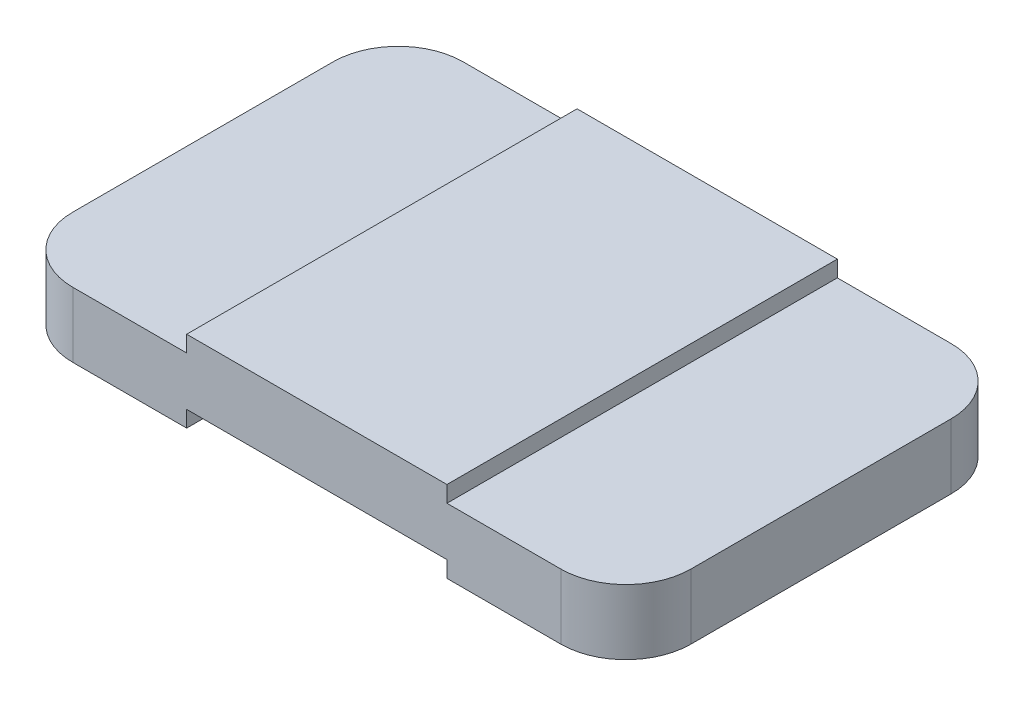
ISO-10303-21;
HEADER;
FILE_DESCRIPTION(('STEP AP214'),'2;1');
FILE_NAME('part.step','',(''),(''),'','','');
FILE_SCHEMA(('AUTOMOTIVE_DESIGN { 1 0 10303 214 1 1 1 1 }'));
ENDSEC;
DATA;
#1=APPLICATION_CONTEXT('core data for automotive mechanical design processes');
#2=APPLICATION_PROTOCOL_DEFINITION('international standard','automotive_design',2000,#1);
#3=PRODUCT_CONTEXT('',#1,'mechanical');
#4=PRODUCT('Part','Part','',(#3));
#5=PRODUCT_RELATED_PRODUCT_CATEGORY('part','',(#4));
#6=PRODUCT_DEFINITION_FORMATION('','',#4);
#7=PRODUCT_DEFINITION_CONTEXT('part definition',#1,'design');
#8=PRODUCT_DEFINITION('design','',#6,#7);
#9=PRODUCT_DEFINITION_SHAPE('','',#8);
#10=(LENGTH_UNIT() NAMED_UNIT(*) SI_UNIT(.MILLI.,.METRE.));
#11=(NAMED_UNIT(*) PLANE_ANGLE_UNIT() SI_UNIT($,.RADIAN.));
#12=(NAMED_UNIT(*) SI_UNIT($,.STERADIAN.) SOLID_ANGLE_UNIT());
#13=UNCERTAINTY_MEASURE_WITH_UNIT(LENGTH_MEASURE(1.E-05),#10,'distance_accuracy_value','');
#14=(GEOMETRIC_REPRESENTATION_CONTEXT(3) GLOBAL_UNCERTAINTY_ASSIGNED_CONTEXT((#13)) GLOBAL_UNIT_ASSIGNED_CONTEXT((#10,
#11,#12)) REPRESENTATION_CONTEXT('',''));
#15=CARTESIAN_POINT('',(0.,0.,0.));
#16=DIRECTION('',(0.,0.,1.));
#17=DIRECTION('',(1.,0.,0.));
#18=AXIS2_PLACEMENT_3D('',#15,#16,#17);
#19=CARTESIAN_POINT('',(0.,0.5,-3.));
#20=DIRECTION('',(-1.,0.,0.));
#21=DIRECTION('',(0.,-1.,0.));
#22=AXIS2_PLACEMENT_3D('',#19,#20,#21);
#23=PLANE('',#22);
#24=DIRECTION('',(0.,0.,1.));
#25=VECTOR('',#24,1.);
#26=CARTESIAN_POINT('',(0.,0.5,-3.));
#27=LINE('',#26,#25);
#28=CARTESIAN_POINT('',(0.,0.5,-2.5));
#29=VERTEX_POINT('',#28);
#30=CARTESIAN_POINT('',(0.,0.5,-0.5));
#31=VERTEX_POINT('',#30);
#32=EDGE_CURVE('E218',#29,#31,#27,.T.);
#33=ORIENTED_EDGE('',*,*,#32,.F.);
#34=DIRECTION('',(0.,-1.,0.));
#35=VECTOR('',#34,1.);
#36=CARTESIAN_POINT('',(0.,0.,-2.5));
#37=LINE('',#36,#35);
#38=CARTESIAN_POINT('',(0.,0.,-2.5));
#39=VERTEX_POINT('',#38);
#40=EDGE_CURVE('E267',#29,#39,#37,.T.);
#41=ORIENTED_EDGE('',*,*,#40,.T.);
#42=DIRECTION('',(0.,0.,1.));
#43=VECTOR('',#42,1.);
#44=CARTESIAN_POINT('',(0.,0.,-3.));
#45=LINE('',#44,#43);
#46=CARTESIAN_POINT('',(0.,0.,-0.5));
#47=VERTEX_POINT('',#46);
#48=EDGE_CURVE('E162',#39,#47,#45,.T.);
#49=ORIENTED_EDGE('',*,*,#48,.T.);
#50=DIRECTION('',(0.,-1.,0.));
#51=VECTOR('',#50,1.);
#52=CARTESIAN_POINT('',(0.,0.5,-0.5));
#53=LINE('',#52,#51);
#54=EDGE_CURVE('E265',#47,#31,#53,.F.);
#55=ORIENTED_EDGE('',*,*,#54,.T.);
#56=EDGE_LOOP('',(#33,#41,#49,#55));
#57=FACE_BOUND('',#56,.T.);
#58=ADVANCED_FACE('F33',(#57),#23,.T.);
#59=CARTESIAN_POINT('',(1.375,0.5,-3.));
#60=DIRECTION('',(0.,1.,0.));
#61=DIRECTION('',(-1.,0.,0.));
#62=AXIS2_PLACEMENT_3D('',#59,#60,#61);
#63=PLANE('',#62);
#64=DIRECTION('',(-1.,0.,0.));
#65=VECTOR('',#64,1.);
#66=CARTESIAN_POINT('',(1.375,0.5,-3.));
#67=LINE('',#66,#65);
#68=CARTESIAN_POINT('',(1.375,0.5,-3.));
#69=VERTEX_POINT('',#68);
#70=CARTESIAN_POINT('',(0.5,0.5,-3.));
#71=VERTEX_POINT('',#70);
#72=EDGE_CURVE('E190',#69,#71,#67,.T.);
#73=ORIENTED_EDGE('',*,*,#72,.T.);
#74=CARTESIAN_POINT('',(0.5,0.5,-2.5));
#75=DIRECTION('',(0.,1.,0.));
#76=DIRECTION('',(-1.,0.,0.));
#77=AXIS2_PLACEMENT_3D('',#74,#75,#76);
#78=CIRCLE('',#77,0.5);
#79=EDGE_CURVE('E11',#71,#29,#78,.T.);
#80=ORIENTED_EDGE('',*,*,#79,.T.);
#81=ORIENTED_EDGE('',*,*,#32,.T.);
#82=CARTESIAN_POINT('',(0.5,0.5,-0.5));
#83=DIRECTION('',(0.,1.,0.));
#84=DIRECTION('',(-1.,0.,0.));
#85=AXIS2_PLACEMENT_3D('',#82,#83,#84);
#86=CIRCLE('',#85,0.5);
#87=CARTESIAN_POINT('',(0.5,0.5,0.));
#88=VERTEX_POINT('',#87);
#89=EDGE_CURVE('E41',#31,#88,#86,.T.);
#90=ORIENTED_EDGE('',*,*,#89,.T.);
#91=DIRECTION('',(-1.,0.,0.));
#92=VECTOR('',#91,1.);
#93=CARTESIAN_POINT('',(1.375,0.5,0.));
#94=LINE('',#93,#92);
#95=CARTESIAN_POINT('',(1.375,0.5,0.));
#96=VERTEX_POINT('',#95);
#97=EDGE_CURVE('E154',#96,#88,#94,.T.);
#98=ORIENTED_EDGE('',*,*,#97,.F.);
#99=DIRECTION('',(0.,0.,1.));
#100=VECTOR('',#99,1.);
#101=CARTESIAN_POINT('',(1.375,0.5,-3.));
#102=LINE('',#101,#100);
#103=EDGE_CURVE('E222',#69,#96,#102,.T.);
#104=ORIENTED_EDGE('',*,*,#103,.F.);
#105=EDGE_LOOP('',(#73,#80,#81,#90,#98,#104));
#106=FACE_BOUND('',#105,.T.);
#107=ADVANCED_FACE('F273',(#106),#63,.T.);
#108=CARTESIAN_POINT('',(1.375,0.625,-3.));
#109=DIRECTION('',(-1.,0.,0.));
#110=DIRECTION('',(0.,0.,1.));
#111=AXIS2_PLACEMENT_3D('',#108,#109,#110);
#112=PLANE('',#111);
#113=DIRECTION('',(0.,-1.,0.));
#114=VECTOR('',#113,1.);
#115=CARTESIAN_POINT('',(1.375,0.625,0.));
#116=LINE('',#115,#114);
#117=CARTESIAN_POINT('',(1.375,0.625,0.));
#118=VERTEX_POINT('',#117);
#119=EDGE_CURVE('E213',#118,#96,#116,.T.);
#120=ORIENTED_EDGE('',*,*,#119,.F.);
#121=DIRECTION('',(0.,0.,1.));
#122=VECTOR('',#121,1.);
#123=CARTESIAN_POINT('',(1.375,0.625,-3.));
#124=LINE('',#123,#122);
#125=CARTESIAN_POINT('',(1.375,0.625,-3.));
#126=VERTEX_POINT('',#125);
#127=EDGE_CURVE('E224',#126,#118,#124,.T.);
#128=ORIENTED_EDGE('',*,*,#127,.F.);
#129=DIRECTION('',(0.,-1.,0.));
#130=VECTOR('',#129,1.);
#131=CARTESIAN_POINT('',(1.375,0.625,-3.));
#132=LINE('',#131,#130);
#133=EDGE_CURVE('E187',#126,#69,#132,.T.);
#134=ORIENTED_EDGE('',*,*,#133,.T.);
#135=ORIENTED_EDGE('',*,*,#103,.T.);
#136=EDGE_LOOP('',(#120,#128,#134,#135));
#137=FACE_BOUND('',#136,.T.);
#138=ADVANCED_FACE('F335',(#137),#112,.T.);
#139=CARTESIAN_POINT('',(3.375,0.625,-3.));
#140=DIRECTION('',(0.,1.,0.));
#141=DIRECTION('',(-1.,0.,0.));
#142=AXIS2_PLACEMENT_3D('',#139,#140,#141);
#143=PLANE('',#142);
#144=DIRECTION('',(-1.,0.,0.));
#145=VECTOR('',#144,1.);
#146=CARTESIAN_POINT('',(3.375,0.625,0.));
#147=LINE('',#146,#145);
#148=CARTESIAN_POINT('',(3.375,0.625,0.));
#149=VERTEX_POINT('',#148);
#150=EDGE_CURVE('E210',#149,#118,#147,.T.);
#151=ORIENTED_EDGE('',*,*,#150,.F.);
#152=DIRECTION('',(0.,0.,1.));
#153=VECTOR('',#152,1.);
#154=CARTESIAN_POINT('',(3.375,0.625,-3.));
#155=LINE('',#154,#153);
#156=CARTESIAN_POINT('',(3.375,0.625,-3.));
#157=VERTEX_POINT('',#156);
#158=EDGE_CURVE('E226',#157,#149,#155,.T.);
#159=ORIENTED_EDGE('',*,*,#158,.F.);
#160=DIRECTION('',(-1.,0.,0.));
#161=VECTOR('',#160,1.);
#162=CARTESIAN_POINT('',(3.375,0.625,-3.));
#163=LINE('',#162,#161);
#164=EDGE_CURVE('E184',#157,#126,#163,.T.);
#165=ORIENTED_EDGE('',*,*,#164,.T.);
#166=ORIENTED_EDGE('',*,*,#127,.T.);
#167=EDGE_LOOP('',(#151,#159,#165,#166));
#168=FACE_BOUND('',#167,.T.);
#169=ADVANCED_FACE('F291',(#168),#143,.T.);
#170=CARTESIAN_POINT('',(3.375,0.5,-3.));
#171=DIRECTION('',(1.,0.,0.));
#172=DIRECTION('',(0.,1.,0.));
#173=AXIS2_PLACEMENT_3D('',#170,#171,#172);
#174=PLANE('',#173);
#175=DIRECTION('',(0.,1.,0.));
#176=VECTOR('',#175,1.);
#177=CARTESIAN_POINT('',(3.375,0.5,0.));
#178=LINE('',#177,#176);
#179=CARTESIAN_POINT('',(3.375,0.5,0.));
#180=VERTEX_POINT('',#179);
#181=EDGE_CURVE('E207',#180,#149,#178,.T.);
#182=ORIENTED_EDGE('',*,*,#181,.F.);
#183=DIRECTION('',(0.,0.,1.));
#184=VECTOR('',#183,1.);
#185=CARTESIAN_POINT('',(3.375,0.5,-3.));
#186=LINE('',#185,#184);
#187=CARTESIAN_POINT('',(3.375,0.5,-3.));
#188=VERTEX_POINT('',#187);
#189=EDGE_CURVE('E228',#188,#180,#186,.T.);
#190=ORIENTED_EDGE('',*,*,#189,.F.);
#191=DIRECTION('',(0.,1.,0.));
#192=VECTOR('',#191,1.);
#193=CARTESIAN_POINT('',(3.375,0.5,-3.));
#194=LINE('',#193,#192);
#195=EDGE_CURVE('E181',#188,#157,#194,.T.);
#196=ORIENTED_EDGE('',*,*,#195,.T.);
#197=ORIENTED_EDGE('',*,*,#158,.T.);
#198=EDGE_LOOP('',(#182,#190,#196,#197));
#199=FACE_BOUND('',#198,.T.);
#200=ADVANCED_FACE('F294',(#199),#174,.T.);
#201=CARTESIAN_POINT('',(4.75,0.5,-3.));
#202=DIRECTION('',(0.,1.,0.));
#203=DIRECTION('',(-1.,0.,0.));
#204=AXIS2_PLACEMENT_3D('',#201,#202,#203);
#205=PLANE('',#204);
#206=DIRECTION('',(0.,0.,1.));
#207=VECTOR('',#206,1.);
#208=CARTESIAN_POINT('',(4.75,0.5,-3.));
#209=LINE('',#208,#207);
#210=CARTESIAN_POINT('',(4.75,0.5,-2.5));
#211=VERTEX_POINT('',#210);
#212=CARTESIAN_POINT('',(4.75,0.5,-0.5));
#213=VERTEX_POINT('',#212);
#214=EDGE_CURVE('E231',#211,#213,#209,.T.);
#215=ORIENTED_EDGE('',*,*,#214,.F.);
#216=CARTESIAN_POINT('',(4.25,0.5,-2.5));
#217=DIRECTION('',(0.,1.,0.));
#218=DIRECTION('',(-1.,0.,0.));
#219=AXIS2_PLACEMENT_3D('',#216,#217,#218);
#220=CIRCLE('',#219,0.5);
#221=CARTESIAN_POINT('',(4.25,0.5,-3.));
#222=VERTEX_POINT('',#221);
#223=EDGE_CURVE('E249',#211,#222,#220,.T.);
#224=ORIENTED_EDGE('',*,*,#223,.T.);
#225=DIRECTION('',(-1.,0.,0.));
#226=VECTOR('',#225,1.);
#227=CARTESIAN_POINT('',(4.75,0.5,-3.));
#228=LINE('',#227,#226);
#229=EDGE_CURVE('E179',#222,#188,#228,.T.);
#230=ORIENTED_EDGE('',*,*,#229,.T.);
#231=ORIENTED_EDGE('',*,*,#189,.T.);
#232=DIRECTION('',(-1.,0.,0.));
#233=VECTOR('',#232,1.);
#234=CARTESIAN_POINT('',(4.75,0.5,0.));
#235=LINE('',#234,#233);
#236=CARTESIAN_POINT('',(4.25,0.5,0.));
#237=VERTEX_POINT('',#236);
#238=EDGE_CURVE('E205',#237,#180,#235,.T.);
#239=ORIENTED_EDGE('',*,*,#238,.F.);
#240=CARTESIAN_POINT('',(4.25,0.5,-0.5));
#241=DIRECTION('',(0.,1.,0.));
#242=DIRECTION('',(-1.,0.,0.));
#243=AXIS2_PLACEMENT_3D('',#240,#241,#242);
#244=CIRCLE('',#243,0.5);
#245=EDGE_CURVE('E247',#237,#213,#244,.T.);
#246=ORIENTED_EDGE('',*,*,#245,.T.);
#247=EDGE_LOOP('',(#215,#224,#230,#231,#239,#246));
#248=FACE_BOUND('',#247,.T.);
#249=ADVANCED_FACE('F406',(#248),#205,.T.);
#250=CARTESIAN_POINT('',(4.75,0.,-3.));
#251=DIRECTION('',(1.,0.,0.));
#252=DIRECTION('',(0.,0.,-1.));
#253=AXIS2_PLACEMENT_3D('',#250,#251,#252);
#254=PLANE('',#253);
#255=DIRECTION('',(0.,0.,1.));
#256=VECTOR('',#255,1.);
#257=CARTESIAN_POINT('',(4.75,0.,-3.));
#258=LINE('',#257,#256);
#259=CARTESIAN_POINT('',(4.75,0.,-2.5));
#260=VERTEX_POINT('',#259);
#261=CARTESIAN_POINT('',(4.75,0.,-0.5));
#262=VERTEX_POINT('',#261);
#263=EDGE_CURVE('E234',#260,#262,#258,.T.);
#264=ORIENTED_EDGE('',*,*,#263,.F.);
#265=DIRECTION('',(0.,1.,0.));
#266=VECTOR('',#265,1.);
#267=CARTESIAN_POINT('',(4.75,0.5,-2.5));
#268=LINE('',#267,#266);
#269=EDGE_CURVE('E244',#260,#211,#268,.T.);
#270=ORIENTED_EDGE('',*,*,#269,.T.);
#271=ORIENTED_EDGE('',*,*,#214,.T.);
#272=DIRECTION('',(0.,1.,0.));
#273=VECTOR('',#272,1.);
#274=CARTESIAN_POINT('',(4.75,0.,-0.5));
#275=LINE('',#274,#273);
#276=EDGE_CURVE('E221',#213,#262,#275,.F.);
#277=ORIENTED_EDGE('',*,*,#276,.T.);
#278=EDGE_LOOP('',(#264,#270,#271,#277));
#279=FACE_BOUND('',#278,.T.);
#280=ADVANCED_FACE('F308',(#279),#254,.T.);
#281=CARTESIAN_POINT('',(3.375,0.,-3.));
#282=DIRECTION('',(0.,-1.,0.));
#283=DIRECTION('',(1.,0.,0.));
#284=AXIS2_PLACEMENT_3D('',#281,#282,#283);
#285=PLANE('',#284);
#286=DIRECTION('',(1.,0.,0.));
#287=VECTOR('',#286,1.);
#288=CARTESIAN_POINT('',(3.375,0.,-3.));
#289=LINE('',#288,#287);
#290=CARTESIAN_POINT('',(3.375,0.,-3.));
#291=VERTEX_POINT('',#290);
#292=CARTESIAN_POINT('',(4.25,0.,-3.));
#293=VERTEX_POINT('',#292);
#294=EDGE_CURVE('E176',#291,#293,#289,.T.);
#295=ORIENTED_EDGE('',*,*,#294,.T.);
#296=CARTESIAN_POINT('',(4.25,0.,-2.5));
#297=DIRECTION('',(0.,-1.,0.));
#298=DIRECTION('',(1.,0.,0.));
#299=AXIS2_PLACEMENT_3D('',#296,#297,#298);
#300=CIRCLE('',#299,0.5);
#301=EDGE_CURVE('E257',#293,#260,#300,.T.);
#302=ORIENTED_EDGE('',*,*,#301,.T.);
#303=ORIENTED_EDGE('',*,*,#263,.T.);
#304=CARTESIAN_POINT('',(4.25,0.,-0.5));
#305=DIRECTION('',(0.,-1.,0.));
#306=DIRECTION('',(1.,0.,0.));
#307=AXIS2_PLACEMENT_3D('',#304,#305,#306);
#308=CIRCLE('',#307,0.5);
#309=CARTESIAN_POINT('',(4.25,0.,0.));
#310=VERTEX_POINT('',#309);
#311=EDGE_CURVE('E255',#262,#310,#308,.T.);
#312=ORIENTED_EDGE('',*,*,#311,.T.);
#313=DIRECTION('',(1.,0.,0.));
#314=VECTOR('',#313,1.);
#315=CARTESIAN_POINT('',(3.375,0.,0.));
#316=LINE('',#315,#314);
#317=CARTESIAN_POINT('',(3.375,0.,0.));
#318=VERTEX_POINT('',#317);
#319=EDGE_CURVE('E202',#318,#310,#316,.T.);
#320=ORIENTED_EDGE('',*,*,#319,.F.);
#321=DIRECTION('',(0.,0.,1.));
#322=VECTOR('',#321,1.);
#323=CARTESIAN_POINT('',(3.375,0.,-3.));
#324=LINE('',#323,#322);
#325=EDGE_CURVE('E237',#291,#318,#324,.T.);
#326=ORIENTED_EDGE('',*,*,#325,.F.);
#327=EDGE_LOOP('',(#295,#302,#303,#312,#320,#326));
#328=FACE_BOUND('',#327,.T.);
#329=ADVANCED_FACE('F305',(#328),#285,.T.);
#330=CARTESIAN_POINT('',(3.375,0.125,-3.));
#331=DIRECTION('',(-1.,0.,0.));
#332=DIRECTION('',(0.,0.,1.));
#333=AXIS2_PLACEMENT_3D('',#330,#331,#332);
#334=PLANE('',#333);
#335=DIRECTION('',(0.,-1.,0.));
#336=VECTOR('',#335,1.);
#337=CARTESIAN_POINT('',(3.375,0.125,0.));
#338=LINE('',#337,#336);
#339=CARTESIAN_POINT('',(3.375,0.125,0.));
#340=VERTEX_POINT('',#339);
#341=EDGE_CURVE('E199',#340,#318,#338,.T.);
#342=ORIENTED_EDGE('',*,*,#341,.F.);
#343=DIRECTION('',(0.,0.,1.));
#344=VECTOR('',#343,1.);
#345=CARTESIAN_POINT('',(3.375,0.125,-3.));
#346=LINE('',#345,#344);
#347=CARTESIAN_POINT('',(3.375,0.125,-3.));
#348=VERTEX_POINT('',#347);
#349=EDGE_CURVE('E239',#348,#340,#346,.T.);
#350=ORIENTED_EDGE('',*,*,#349,.F.);
#351=DIRECTION('',(0.,-1.,0.));
#352=VECTOR('',#351,1.);
#353=CARTESIAN_POINT('',(3.375,0.125,-3.));
#354=LINE('',#353,#352);
#355=EDGE_CURVE('E171',#348,#291,#354,.T.);
#356=ORIENTED_EDGE('',*,*,#355,.T.);
#357=ORIENTED_EDGE('',*,*,#325,.T.);
#358=EDGE_LOOP('',(#342,#350,#356,#357));
#359=FACE_BOUND('',#358,.T.);
#360=ADVANCED_FACE('F319',(#359),#334,.T.);
#361=CARTESIAN_POINT('',(1.375,0.125,-3.));
#362=DIRECTION('',(0.,-1.,0.));
#363=DIRECTION('',(0.,0.,-1.));
#364=AXIS2_PLACEMENT_3D('',#361,#362,#363);
#365=PLANE('',#364);
#366=DIRECTION('',(1.,0.,0.));
#367=VECTOR('',#366,1.);
#368=CARTESIAN_POINT('',(1.375,0.125,0.));
#369=LINE('',#368,#367);
#370=CARTESIAN_POINT('',(1.375,0.125,0.));
#371=VERTEX_POINT('',#370);
#372=EDGE_CURVE('E196',#371,#340,#369,.T.);
#373=ORIENTED_EDGE('',*,*,#372,.F.);
#374=DIRECTION('',(0.,0.,1.));
#375=VECTOR('',#374,1.);
#376=CARTESIAN_POINT('',(1.375,0.125,-3.));
#377=LINE('',#376,#375);
#378=CARTESIAN_POINT('',(1.375,0.125,-3.));
#379=VERTEX_POINT('',#378);
#380=EDGE_CURVE('E161',#379,#371,#377,.T.);
#381=ORIENTED_EDGE('',*,*,#380,.F.);
#382=DIRECTION('',(1.,0.,0.));
#383=VECTOR('',#382,1.);
#384=CARTESIAN_POINT('',(1.375,0.125,-3.));
#385=LINE('',#384,#383);
#386=EDGE_CURVE('E169',#379,#348,#385,.T.);
#387=ORIENTED_EDGE('',*,*,#386,.T.);
#388=ORIENTED_EDGE('',*,*,#349,.T.);
#389=EDGE_LOOP('',(#373,#381,#387,#388));
#390=FACE_BOUND('',#389,.T.);
#391=ADVANCED_FACE('F321',(#390),#365,.T.);
#392=CARTESIAN_POINT('',(1.375,0.,-3.));
#393=DIRECTION('',(1.,0.,0.));
#394=DIRECTION('',(0.,0.,-1.));
#395=AXIS2_PLACEMENT_3D('',#392,#393,#394);
#396=PLANE('',#395);
#397=DIRECTION('',(0.,1.,0.));
#398=VECTOR('',#397,1.);
#399=CARTESIAN_POINT('',(1.375,0.,0.));
#400=LINE('',#399,#398);
#401=CARTESIAN_POINT('',(1.375,0.,0.));
#402=VERTEX_POINT('',#401);
#403=EDGE_CURVE('E160',#402,#371,#400,.T.);
#404=ORIENTED_EDGE('',*,*,#403,.F.);
#405=DIRECTION('',(0.,0.,1.));
#406=VECTOR('',#405,1.);
#407=CARTESIAN_POINT('',(1.375,0.,-3.));
#408=LINE('',#407,#406);
#409=CARTESIAN_POINT('',(1.375,0.,-3.));
#410=VERTEX_POINT('',#409);
#411=EDGE_CURVE('E149',#410,#402,#408,.T.);
#412=ORIENTED_EDGE('',*,*,#411,.F.);
#413=DIRECTION('',(0.,1.,0.));
#414=VECTOR('',#413,1.);
#415=CARTESIAN_POINT('',(1.375,0.,-3.));
#416=LINE('',#415,#414);
#417=EDGE_CURVE('E153',#410,#379,#416,.T.);
#418=ORIENTED_EDGE('',*,*,#417,.T.);
#419=ORIENTED_EDGE('',*,*,#380,.T.);
#420=EDGE_LOOP('',(#404,#412,#418,#419));
#421=FACE_BOUND('',#420,.T.);
#422=ADVANCED_FACE('F158',(#421),#396,.T.);
#423=CARTESIAN_POINT('',(0.,0.,-3.));
#424=DIRECTION('',(0.,-1.,0.));
#425=DIRECTION('',(0.,0.,-1.));
#426=AXIS2_PLACEMENT_3D('',#423,#424,#425);
#427=PLANE('',#426);
#428=ORIENTED_EDGE('',*,*,#48,.F.);
#429=CARTESIAN_POINT('',(0.5,0.,-2.5));
#430=DIRECTION('',(0.,-1.,0.));
#431=DIRECTION('',(0.,0.,-1.));
#432=AXIS2_PLACEMENT_3D('',#429,#430,#431);
#433=CIRCLE('',#432,0.5);
#434=CARTESIAN_POINT('',(0.5,0.,-3.));
#435=VERTEX_POINT('',#434);
#436=EDGE_CURVE('E56',#39,#435,#433,.T.);
#437=ORIENTED_EDGE('',*,*,#436,.T.);
#438=DIRECTION('',(1.,0.,0.));
#439=VECTOR('',#438,1.);
#440=CARTESIAN_POINT('',(0.,0.,-3.));
#441=LINE('',#440,#439);
#442=EDGE_CURVE('E146',#435,#410,#441,.T.);
#443=ORIENTED_EDGE('',*,*,#442,.T.);
#444=ORIENTED_EDGE('',*,*,#411,.T.);
#445=DIRECTION('',(1.,0.,0.));
#446=VECTOR('',#445,1.);
#447=CARTESIAN_POINT('',(0.,0.,0.));
#448=LINE('',#447,#446);
#449=CARTESIAN_POINT('',(0.5,0.,0.));
#450=VERTEX_POINT('',#449);
#451=EDGE_CURVE('E193',#450,#402,#448,.T.);
#452=ORIENTED_EDGE('',*,*,#451,.F.);
#453=CARTESIAN_POINT('',(0.5,0.,-0.5));
#454=DIRECTION('',(0.,-1.,0.));
#455=DIRECTION('',(0.,0.,-1.));
#456=AXIS2_PLACEMENT_3D('',#453,#454,#455);
#457=CIRCLE('',#456,0.5);
#458=EDGE_CURVE('E48',#450,#47,#457,.T.);
#459=ORIENTED_EDGE('',*,*,#458,.T.);
#460=EDGE_LOOP('',(#428,#437,#443,#444,#452,#459));
#461=FACE_BOUND('',#460,.T.);
#462=ADVANCED_FACE('F148',(#461),#427,.T.);
#463=CARTESIAN_POINT('',(0.,0.,-3.));
#464=DIRECTION('',(0.,0.,1.));
#465=DIRECTION('',(1.,0.,0.));
#466=AXIS2_PLACEMENT_3D('',#463,#464,#465);
#467=PLANE('',#466);
#468=ORIENTED_EDGE('',*,*,#229,.F.);
#469=DIRECTION('',(0.,1.,0.));
#470=VECTOR('',#469,1.);
#471=CARTESIAN_POINT('',(4.25,0.,-3.));
#472=LINE('',#471,#470);
#473=EDGE_CURVE('E253',#222,#293,#472,.F.);
#474=ORIENTED_EDGE('',*,*,#473,.T.);
#475=ORIENTED_EDGE('',*,*,#294,.F.);
#476=ORIENTED_EDGE('',*,*,#355,.F.);
#477=ORIENTED_EDGE('',*,*,#386,.F.);
#478=ORIENTED_EDGE('',*,*,#417,.F.);
#479=ORIENTED_EDGE('',*,*,#442,.F.);
#480=DIRECTION('',(0.,-1.,0.));
#481=VECTOR('',#480,1.);
#482=CARTESIAN_POINT('',(0.5,0.5,-3.));
#483=LINE('',#482,#481);
#484=EDGE_CURVE('E251',#435,#71,#483,.F.);
#485=ORIENTED_EDGE('',*,*,#484,.T.);
#486=ORIENTED_EDGE('',*,*,#72,.F.);
#487=ORIENTED_EDGE('',*,*,#133,.F.);
#488=ORIENTED_EDGE('',*,*,#164,.F.);
#489=ORIENTED_EDGE('',*,*,#195,.F.);
#490=EDGE_LOOP('',(#468,#474,#475,#476,#477,#478,#479,#485,#486,#487,#488,#489));
#491=FACE_BOUND('',#490,.T.);
#492=ADVANCED_FACE('F166',(#491),#467,.F.);
#493=CARTESIAN_POINT('',(0.,0.,0.));
#494=DIRECTION('',(0.,0.,1.));
#495=DIRECTION('',(1.,0.,0.));
#496=AXIS2_PLACEMENT_3D('',#493,#494,#495);
#497=PLANE('',#496);
#498=ORIENTED_EDGE('',*,*,#319,.T.);
#499=DIRECTION('',(0.,1.,0.));
#500=VECTOR('',#499,1.);
#501=CARTESIAN_POINT('',(4.25,0.,0.));
#502=LINE('',#501,#500);
#503=EDGE_CURVE('E262',#310,#237,#502,.T.);
#504=ORIENTED_EDGE('',*,*,#503,.T.);
#505=ORIENTED_EDGE('',*,*,#238,.T.);
#506=ORIENTED_EDGE('',*,*,#181,.T.);
#507=ORIENTED_EDGE('',*,*,#150,.T.);
#508=ORIENTED_EDGE('',*,*,#119,.T.);
#509=ORIENTED_EDGE('',*,*,#97,.T.);
#510=DIRECTION('',(0.,-1.,0.));
#511=VECTOR('',#510,1.);
#512=CARTESIAN_POINT('',(0.5,0.,0.));
#513=LINE('',#512,#511);
#514=EDGE_CURVE('E259',#88,#450,#513,.T.);
#515=ORIENTED_EDGE('',*,*,#514,.T.);
#516=ORIENTED_EDGE('',*,*,#451,.T.);
#517=ORIENTED_EDGE('',*,*,#403,.T.);
#518=ORIENTED_EDGE('',*,*,#372,.T.);
#519=ORIENTED_EDGE('',*,*,#341,.T.);
#520=EDGE_LOOP('',(#498,#504,#505,#506,#507,#508,#509,#515,#516,#517,#518,#519));
#521=FACE_BOUND('',#520,.T.);
#522=ADVANCED_FACE('F279',(#521),#497,.T.);
#523=CARTESIAN_POINT('',(4.25,0.,-2.5));
#524=DIRECTION('',(0.,-1.,0.));
#525=DIRECTION('',(0.,0.,-1.));
#526=AXIS2_PLACEMENT_3D('',#523,#524,#525);
#527=CYLINDRICAL_SURFACE('',#526,0.5);
#528=ORIENTED_EDGE('',*,*,#301,.F.);
#529=ORIENTED_EDGE('',*,*,#473,.F.);
#530=ORIENTED_EDGE('',*,*,#223,.F.);
#531=ORIENTED_EDGE('',*,*,#269,.F.);
#532=EDGE_LOOP('',(#528,#529,#530,#531));
#533=FACE_BOUND('',#532,.T.);
#534=ADVANCED_FACE('F301',(#533),#527,.T.);
#535=CARTESIAN_POINT('',(4.25,0.,-0.5));
#536=DIRECTION('',(0.,1.,0.));
#537=DIRECTION('',(0.,0.,1.));
#538=AXIS2_PLACEMENT_3D('',#535,#536,#537);
#539=CYLINDRICAL_SURFACE('',#538,0.5);
#540=ORIENTED_EDGE('',*,*,#311,.F.);
#541=ORIENTED_EDGE('',*,*,#276,.F.);
#542=ORIENTED_EDGE('',*,*,#245,.F.);
#543=ORIENTED_EDGE('',*,*,#503,.F.);
#544=EDGE_LOOP('',(#540,#541,#542,#543));
#545=FACE_BOUND('',#544,.T.);
#546=ADVANCED_FACE('F312',(#545),#539,.T.);
#547=CARTESIAN_POINT('',(0.5,0.5,-2.5));
#548=DIRECTION('',(0.,1.,0.));
#549=DIRECTION('',(-1.,0.,0.));
#550=AXIS2_PLACEMENT_3D('',#547,#548,#549);
#551=CYLINDRICAL_SURFACE('',#550,0.5);
#552=ORIENTED_EDGE('',*,*,#79,.F.);
#553=ORIENTED_EDGE('',*,*,#484,.F.);
#554=ORIENTED_EDGE('',*,*,#436,.F.);
#555=ORIENTED_EDGE('',*,*,#40,.F.);
#556=EDGE_LOOP('',(#552,#553,#554,#555));
#557=FACE_BOUND('',#556,.T.);
#558=ADVANCED_FACE('F283',(#557),#551,.T.);
#559=CARTESIAN_POINT('',(0.5,0.,-0.5));
#560=DIRECTION('',(0.,-1.,0.));
#561=DIRECTION('',(1.,0.,0.));
#562=AXIS2_PLACEMENT_3D('',#559,#560,#561);
#563=CYLINDRICAL_SURFACE('',#562,0.5);
#564=ORIENTED_EDGE('',*,*,#89,.F.);
#565=ORIENTED_EDGE('',*,*,#54,.F.);
#566=ORIENTED_EDGE('',*,*,#458,.F.);
#567=ORIENTED_EDGE('',*,*,#514,.F.);
#568=EDGE_LOOP('',(#564,#565,#566,#567));
#569=FACE_BOUND('',#568,.T.);
#570=ADVANCED_FACE('F35',(#569),#563,.T.);
#571=CLOSED_SHELL('',(#58,#107,#138,#169,#200,#249,#280,#329,#360,#391,#422,#462,#492,#522,#534,
#546,#558,#570));
#572=MANIFOLD_SOLID_BREP('B2',#571);
#573=ADVANCED_BREP_SHAPE_REPRESENTATION('',(#18,#572),#14);
#574=SHAPE_DEFINITION_REPRESENTATION(#9,#573);
ENDSEC;
END-ISO-10303-21;
